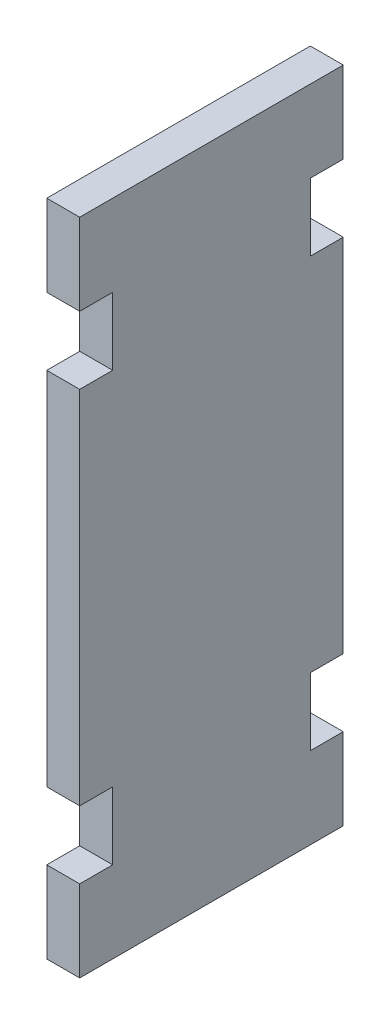
ISO-10303-21;
HEADER;
FILE_DESCRIPTION(('STEP AP214'),'2;1');
FILE_NAME('part.step','',(''),(''),'','','');
FILE_SCHEMA(('AUTOMOTIVE_DESIGN { 1 0 10303 214 1 1 1 1 }'));
ENDSEC;
DATA;
#1=APPLICATION_CONTEXT('core data for automotive mechanical design processes');
#2=APPLICATION_PROTOCOL_DEFINITION('international standard','automotive_design',2000,#1);
#3=PRODUCT_CONTEXT('',#1,'mechanical');
#4=PRODUCT('Part','Part','',(#3));
#5=PRODUCT_RELATED_PRODUCT_CATEGORY('part','',(#4));
#6=PRODUCT_DEFINITION_FORMATION('','',#4);
#7=PRODUCT_DEFINITION_CONTEXT('part definition',#1,'design');
#8=PRODUCT_DEFINITION('design','',#6,#7);
#9=PRODUCT_DEFINITION_SHAPE('','',#8);
#10=(LENGTH_UNIT() NAMED_UNIT(*) SI_UNIT(.MILLI.,.METRE.));
#11=(NAMED_UNIT(*) PLANE_ANGLE_UNIT() SI_UNIT($,.RADIAN.));
#12=(NAMED_UNIT(*) SI_UNIT($,.STERADIAN.) SOLID_ANGLE_UNIT());
#13=UNCERTAINTY_MEASURE_WITH_UNIT(LENGTH_MEASURE(1.E-05),#10,'distance_accuracy_value','');
#14=(GEOMETRIC_REPRESENTATION_CONTEXT(3) GLOBAL_UNCERTAINTY_ASSIGNED_CONTEXT((#13)) GLOBAL_UNIT_ASSIGNED_CONTEXT((#10,
#11,#12)) REPRESENTATION_CONTEXT('',''));
#15=CARTESIAN_POINT('',(0.,0.,0.));
#16=DIRECTION('',(0.,0.,1.));
#17=DIRECTION('',(1.,0.,0.));
#18=AXIS2_PLACEMENT_3D('',#15,#16,#17);
#19=CARTESIAN_POINT('',(4.99999999999999,-77.375,-15.));
#20=DIRECTION('',(0.,-1.,0.));
#21=DIRECTION('',(0.,0.,-0.999999999999997));
#22=AXIS2_PLACEMENT_3D('',#19,#20,#21);
#23=PLANE('',#22);
#24=DIRECTION('',(1.,0.,0.));
#25=VECTOR('',#24,1.);
#26=CARTESIAN_POINT('',(4.99999999999999,-77.375,-15.));
#27=LINE('',#26,#25);
#28=CARTESIAN_POINT('',(0.,-77.3750000000001,-14.9999999999997));
#29=VERTEX_POINT('',#28);
#30=CARTESIAN_POINT('',(4.99999999999999,-77.375,-15.));
#31=VERTEX_POINT('',#30);
#32=EDGE_CURVE('E11',#29,#31,#27,.T.);
#33=ORIENTED_EDGE('',*,*,#32,.F.);
#34=DIRECTION('',(0.,0.,-0.999999999999997));
#35=VECTOR('',#34,1.);
#36=CARTESIAN_POINT('',(0.,-77.3750000000001,19.9999999999999));
#37=LINE('',#36,#35);
#38=CARTESIAN_POINT('',(0.,-77.3750000000001,-19.9999999999997));
#39=VERTEX_POINT('',#38);
#40=EDGE_CURVE('E146',#29,#39,#37,.T.);
#41=ORIENTED_EDGE('',*,*,#40,.T.);
#42=DIRECTION('',(1.,0.,0.));
#43=VECTOR('',#42,1.);
#44=CARTESIAN_POINT('',(4.99999999999999,-77.375,-19.9999999999999));
#45=LINE('',#44,#43);
#46=CARTESIAN_POINT('',(4.99999999999999,-77.375,-19.9999999999999));
#47=VERTEX_POINT('',#46);
#48=EDGE_CURVE('E53',#39,#47,#45,.T.);
#49=ORIENTED_EDGE('',*,*,#48,.T.);
#50=DIRECTION('',(0.,0.,-0.999999999999997));
#51=VECTOR('',#50,1.);
#52=CARTESIAN_POINT('',(4.99999999999999,-77.375,-15.));
#53=LINE('',#52,#51);
#54=EDGE_CURVE('E279',#31,#47,#53,.T.);
#55=ORIENTED_EDGE('',*,*,#54,.F.);
#56=EDGE_LOOP('',(#33,#41,#49,#55));
#57=FACE_BOUND('',#56,.T.);
#58=ADVANCED_FACE('F43',(#57),#23,.T.);
#59=CARTESIAN_POINT('',(4.99999999999999,-100.,-19.9999999999999));
#60=DIRECTION('',(0.,0.,-1.));
#61=DIRECTION('',(0.,1.,0.));
#62=AXIS2_PLACEMENT_3D('',#59,#60,#61);
#63=PLANE('',#62);
#64=ORIENTED_EDGE('',*,*,#48,.F.);
#65=DIRECTION('',(0.,0.999999999999997,0.));
#66=VECTOR('',#65,1.);
#67=CARTESIAN_POINT('',(0.,-100.,-19.9999999999997));
#68=LINE('',#67,#66);
#69=CARTESIAN_POINT('',(0.,-22.6250000000005,-19.9999999999997));
#70=VERTEX_POINT('',#69);
#71=EDGE_CURVE('E221',#39,#70,#68,.T.);
#72=ORIENTED_EDGE('',*,*,#71,.T.);
#73=DIRECTION('',(1.,0.,0.));
#74=VECTOR('',#73,1.);
#75=CARTESIAN_POINT('',(4.99999999999999,-22.625,-19.9999999999999));
#76=LINE('',#75,#74);
#77=CARTESIAN_POINT('',(4.99999999999999,-22.625,-19.9999999999999));
#78=VERTEX_POINT('',#77);
#79=EDGE_CURVE('E272',#70,#78,#76,.T.);
#80=ORIENTED_EDGE('',*,*,#79,.T.);
#81=DIRECTION('',(0.,1.,0.));
#82=VECTOR('',#81,1.);
#83=CARTESIAN_POINT('',(4.99999999999999,-100.,-19.9999999999999));
#84=LINE('',#83,#82);
#85=EDGE_CURVE('E288',#47,#78,#84,.T.);
#86=ORIENTED_EDGE('',*,*,#85,.F.);
#87=EDGE_LOOP('',(#64,#72,#80,#86));
#88=FACE_BOUND('',#87,.T.);
#89=ADVANCED_FACE('F292',(#88),#63,.T.);
#90=CARTESIAN_POINT('',(4.99999999999999,-22.625,-15.));
#91=DIRECTION('',(0.,1.,0.));
#92=DIRECTION('',(0.,0.,0.999999999999997));
#93=AXIS2_PLACEMENT_3D('',#90,#91,#92);
#94=PLANE('',#93);
#95=ORIENTED_EDGE('',*,*,#79,.F.);
#96=DIRECTION('',(0.,0.,-0.999999999999997));
#97=VECTOR('',#96,1.);
#98=CARTESIAN_POINT('',(0.,-22.6250000000005,19.9999999999999));
#99=LINE('',#98,#97);
#100=CARTESIAN_POINT('',(0.,-22.6250000000005,-14.9999999999997));
#101=VERTEX_POINT('',#100);
#102=EDGE_CURVE('E217',#70,#101,#99,.F.);
#103=ORIENTED_EDGE('',*,*,#102,.T.);
#104=DIRECTION('',(1.,0.,0.));
#105=VECTOR('',#104,1.);
#106=CARTESIAN_POINT('',(4.99999999999999,-22.625,-15.));
#107=LINE('',#106,#105);
#108=CARTESIAN_POINT('',(4.99999999999999,-22.625,-15.));
#109=VERTEX_POINT('',#108);
#110=EDGE_CURVE('E269',#101,#109,#107,.T.);
#111=ORIENTED_EDGE('',*,*,#110,.T.);
#112=DIRECTION('',(0.,0.,0.999999999999997));
#113=VECTOR('',#112,1.);
#114=CARTESIAN_POINT('',(4.99999999999999,-22.625,-15.));
#115=LINE('',#114,#113);
#116=EDGE_CURVE('E294',#78,#109,#115,.T.);
#117=ORIENTED_EDGE('',*,*,#116,.F.);
#118=EDGE_LOOP('',(#95,#103,#111,#117));
#119=FACE_BOUND('',#118,.T.);
#120=ADVANCED_FACE('F451',(#119),#94,.T.);
#121=CARTESIAN_POINT('',(4.99999999999999,-22.625,-15.));
#122=DIRECTION('',(0.,0.,-1.));
#123=DIRECTION('',(0.,1.,0.));
#124=AXIS2_PLACEMENT_3D('',#121,#122,#123);
#125=PLANE('',#124);
#126=ORIENTED_EDGE('',*,*,#110,.F.);
#127=DIRECTION('',(0.,0.999999999999997,0.));
#128=VECTOR('',#127,1.);
#129=CARTESIAN_POINT('',(0.,-100.,-14.9999999999997));
#130=LINE('',#129,#128);
#131=CARTESIAN_POINT('',(0.,-12.3750000000006,-14.9999999999997));
#132=VERTEX_POINT('',#131);
#133=EDGE_CURVE('E213',#101,#132,#130,.T.);
#134=ORIENTED_EDGE('',*,*,#133,.T.);
#135=DIRECTION('',(1.,0.,0.));
#136=VECTOR('',#135,1.);
#137=CARTESIAN_POINT('',(4.99999999999999,-12.3750000000001,-15.));
#138=LINE('',#137,#136);
#139=CARTESIAN_POINT('',(4.99999999999999,-12.3750000000001,-15.));
#140=VERTEX_POINT('',#139);
#141=EDGE_CURVE('E266',#132,#140,#138,.T.);
#142=ORIENTED_EDGE('',*,*,#141,.T.);
#143=DIRECTION('',(0.,1.,0.));
#144=VECTOR('',#143,1.);
#145=CARTESIAN_POINT('',(4.99999999999999,-22.625,-15.));
#146=LINE('',#145,#144);
#147=EDGE_CURVE('E299',#109,#140,#146,.T.);
#148=ORIENTED_EDGE('',*,*,#147,.F.);
#149=EDGE_LOOP('',(#126,#134,#142,#148));
#150=FACE_BOUND('',#149,.T.);
#151=ADVANCED_FACE('F448',(#150),#125,.T.);
#152=CARTESIAN_POINT('',(4.99999999999999,-12.3750000000001,-15.));
#153=DIRECTION('',(0.,-1.,0.));
#154=DIRECTION('',(0.,0.,-0.999999999999997));
#155=AXIS2_PLACEMENT_3D('',#152,#153,#154);
#156=PLANE('',#155);
#157=ORIENTED_EDGE('',*,*,#141,.F.);
#158=DIRECTION('',(0.,0.,-0.999999999999997));
#159=VECTOR('',#158,1.);
#160=CARTESIAN_POINT('',(0.,-12.3750000000006,19.9999999999999));
#161=LINE('',#160,#159);
#162=CARTESIAN_POINT('',(0.,-12.3750000000006,-19.9999999999997));
#163=VERTEX_POINT('',#162);
#164=EDGE_CURVE('E209',#132,#163,#161,.T.);
#165=ORIENTED_EDGE('',*,*,#164,.T.);
#166=DIRECTION('',(1.,0.,0.));
#167=VECTOR('',#166,1.);
#168=CARTESIAN_POINT('',(4.99999999999999,-12.3750000000001,-19.9999999999999));
#169=LINE('',#168,#167);
#170=CARTESIAN_POINT('',(4.99999999999999,-12.3750000000001,-19.9999999999999));
#171=VERTEX_POINT('',#170);
#172=EDGE_CURVE('E263',#163,#171,#169,.T.);
#173=ORIENTED_EDGE('',*,*,#172,.T.);
#174=DIRECTION('',(0.,0.,-0.999999999999997));
#175=VECTOR('',#174,1.);
#176=CARTESIAN_POINT('',(4.99999999999999,-12.3750000000001,-15.));
#177=LINE('',#176,#175);
#178=EDGE_CURVE('E306',#140,#171,#177,.T.);
#179=ORIENTED_EDGE('',*,*,#178,.F.);
#180=EDGE_LOOP('',(#157,#165,#173,#179));
#181=FACE_BOUND('',#180,.T.);
#182=ADVANCED_FACE('F444',(#181),#156,.T.);
#183=ORIENTED_EDGE('',*,*,#172,.F.);
#184=DIRECTION('',(0.,0.999999999999997,0.));
#185=VECTOR('',#184,1.);
#186=CARTESIAN_POINT('',(0.,-100.,-19.9999999999997));
#187=LINE('',#186,#185);
#188=CARTESIAN_POINT('',(0.,-6.66133814775094E-13,-19.9999999999997));
#189=VERTEX_POINT('',#188);
#190=EDGE_CURVE('E205',#163,#189,#187,.T.);
#191=ORIENTED_EDGE('',*,*,#190,.T.);
#192=DIRECTION('',(1.,0.,0.));
#193=VECTOR('',#192,1.);
#194=CARTESIAN_POINT('',(4.99999999999999,0.,-19.9999999999999));
#195=LINE('',#194,#193);
#196=CARTESIAN_POINT('',(4.99999999999999,0.,-19.9999999999999));
#197=VERTEX_POINT('',#196);
#198=EDGE_CURVE('E260',#189,#197,#195,.T.);
#199=ORIENTED_EDGE('',*,*,#198,.T.);
#200=EDGE_CURVE('E296',#171,#197,#84,.T.);
#201=ORIENTED_EDGE('',*,*,#200,.F.);
#202=EDGE_LOOP('',(#183,#191,#199,#201));
#203=FACE_BOUND('',#202,.T.);
#204=ADVANCED_FACE('F442',(#203),#63,.T.);
#205=CARTESIAN_POINT('',(5.,0.,19.9999999999999));
#206=DIRECTION('',(0.,-1.,0.));
#207=DIRECTION('',(0.,0.,-0.999999999999997));
#208=AXIS2_PLACEMENT_3D('',#205,#206,#207);
#209=PLANE('',#208);
#210=ORIENTED_EDGE('',*,*,#198,.F.);
#211=DIRECTION('',(0.,0.,-0.999999999999997));
#212=VECTOR('',#211,1.);
#213=CARTESIAN_POINT('',(0.,-6.66133814775094E-13,19.9999999999999));
#214=LINE('',#213,#212);
#215=CARTESIAN_POINT('',(0.,-6.66133814775094E-13,19.9999999999999));
#216=VERTEX_POINT('',#215);
#217=EDGE_CURVE('E201',#216,#189,#214,.T.);
#218=ORIENTED_EDGE('',*,*,#217,.F.);
#219=DIRECTION('',(1.,0.,0.));
#220=VECTOR('',#219,1.);
#221=CARTESIAN_POINT('',(5.,0.,19.9999999999999));
#222=LINE('',#221,#220);
#223=CARTESIAN_POINT('',(5.,0.,19.9999999999999));
#224=VERTEX_POINT('',#223);
#225=EDGE_CURVE('E257',#216,#224,#222,.T.);
#226=ORIENTED_EDGE('',*,*,#225,.T.);
#227=DIRECTION('',(0.,0.,-0.999999999999997));
#228=VECTOR('',#227,1.);
#229=CARTESIAN_POINT('',(5.,0.,19.9999999999999));
#230=LINE('',#229,#228);
#231=EDGE_CURVE('E305',#224,#197,#230,.T.);
#232=ORIENTED_EDGE('',*,*,#231,.T.);
#233=EDGE_LOOP('',(#210,#218,#226,#232));
#234=FACE_BOUND('',#233,.T.);
#235=ADVANCED_FACE('F437',(#234),#209,.F.);
#236=CARTESIAN_POINT('',(5.,-100.,19.9999999999999));
#237=DIRECTION('',(0.,0.,-1.));
#238=DIRECTION('',(0.,1.,0.));
#239=AXIS2_PLACEMENT_3D('',#236,#237,#238);
#240=PLANE('',#239);
#241=ORIENTED_EDGE('',*,*,#225,.F.);
#242=DIRECTION('',(0.,0.999999999999997,0.));
#243=VECTOR('',#242,1.);
#244=CARTESIAN_POINT('',(0.,-100.,19.9999999999999));
#245=LINE('',#244,#243);
#246=CARTESIAN_POINT('',(0.,-12.3750000000006,19.9999999999999));
#247=VERTEX_POINT('',#246);
#248=EDGE_CURVE('E197',#247,#216,#245,.T.);
#249=ORIENTED_EDGE('',*,*,#248,.F.);
#250=DIRECTION('',(1.,0.,0.));
#251=VECTOR('',#250,1.);
#252=CARTESIAN_POINT('',(5.,-12.3750000000001,19.9999999999999));
#253=LINE('',#252,#251);
#254=CARTESIAN_POINT('',(5.,-12.3750000000001,19.9999999999999));
#255=VERTEX_POINT('',#254);
#256=EDGE_CURVE('E254',#247,#255,#253,.T.);
#257=ORIENTED_EDGE('',*,*,#256,.T.);
#258=DIRECTION('',(0.,1.,0.));
#259=VECTOR('',#258,1.);
#260=CARTESIAN_POINT('',(5.,-100.,19.9999999999999));
#261=LINE('',#260,#259);
#262=EDGE_CURVE('E315',#255,#224,#261,.T.);
#263=ORIENTED_EDGE('',*,*,#262,.T.);
#264=EDGE_LOOP('',(#241,#249,#257,#263));
#265=FACE_BOUND('',#264,.T.);
#266=ADVANCED_FACE('F435',(#265),#240,.F.);
#267=CARTESIAN_POINT('',(5.,-12.3750000000001,14.9999999999999));
#268=DIRECTION('',(0.,-1.,0.));
#269=DIRECTION('',(0.,0.,-0.999999999999997));
#270=AXIS2_PLACEMENT_3D('',#267,#268,#269);
#271=PLANE('',#270);
#272=ORIENTED_EDGE('',*,*,#256,.F.);
#273=DIRECTION('',(0.,0.,-0.999999999999997));
#274=VECTOR('',#273,1.);
#275=CARTESIAN_POINT('',(0.,-12.3750000000006,19.9999999999999));
#276=LINE('',#275,#274);
#277=CARTESIAN_POINT('',(0.,-12.3750000000006,15.));
#278=VERTEX_POINT('',#277);
#279=EDGE_CURVE('E193',#247,#278,#276,.T.);
#280=ORIENTED_EDGE('',*,*,#279,.T.);
#281=DIRECTION('',(1.,0.,0.));
#282=VECTOR('',#281,1.);
#283=CARTESIAN_POINT('',(5.,-12.3750000000001,14.9999999999999));
#284=LINE('',#283,#282);
#285=CARTESIAN_POINT('',(5.,-12.3750000000001,14.9999999999999));
#286=VERTEX_POINT('',#285);
#287=EDGE_CURVE('E251',#278,#286,#284,.T.);
#288=ORIENTED_EDGE('',*,*,#287,.T.);
#289=DIRECTION('',(0.,0.,-0.999999999999997));
#290=VECTOR('',#289,1.);
#291=CARTESIAN_POINT('',(5.,-12.3750000000001,14.9999999999999));
#292=LINE('',#291,#290);
#293=EDGE_CURVE('E328',#255,#286,#292,.T.);
#294=ORIENTED_EDGE('',*,*,#293,.F.);
#295=EDGE_LOOP('',(#272,#280,#288,#294));
#296=FACE_BOUND('',#295,.T.);
#297=ADVANCED_FACE('F433',(#296),#271,.T.);
#298=CARTESIAN_POINT('',(5.,-22.625,14.9999999999999));
#299=DIRECTION('',(0.,0.,1.));
#300=DIRECTION('',(0.,-1.,0.));
#301=AXIS2_PLACEMENT_3D('',#298,#299,#300);
#302=PLANE('',#301);
#303=ORIENTED_EDGE('',*,*,#287,.F.);
#304=DIRECTION('',(0.,0.999999999999997,0.));
#305=VECTOR('',#304,1.);
#306=CARTESIAN_POINT('',(0.,-100.,15.));
#307=LINE('',#306,#305);
#308=CARTESIAN_POINT('',(0.,-22.6250000000005,15.));
#309=VERTEX_POINT('',#308);
#310=EDGE_CURVE('E189',#278,#309,#307,.F.);
#311=ORIENTED_EDGE('',*,*,#310,.T.);
#312=DIRECTION('',(1.,0.,0.));
#313=VECTOR('',#312,1.);
#314=CARTESIAN_POINT('',(5.,-22.625,14.9999999999999));
#315=LINE('',#314,#313);
#316=CARTESIAN_POINT('',(5.,-22.625,14.9999999999999));
#317=VERTEX_POINT('',#316);
#318=EDGE_CURVE('E248',#309,#317,#315,.T.);
#319=ORIENTED_EDGE('',*,*,#318,.T.);
#320=DIRECTION('',(0.,-1.,0.));
#321=VECTOR('',#320,1.);
#322=CARTESIAN_POINT('',(5.,-22.625,14.9999999999999));
#323=LINE('',#322,#321);
#324=EDGE_CURVE('E334',#286,#317,#323,.T.);
#325=ORIENTED_EDGE('',*,*,#324,.F.);
#326=EDGE_LOOP('',(#303,#311,#319,#325));
#327=FACE_BOUND('',#326,.T.);
#328=ADVANCED_FACE('F423',(#327),#302,.T.);
#329=CARTESIAN_POINT('',(5.,-22.625,14.9999999999999));
#330=DIRECTION('',(0.,1.,0.));
#331=DIRECTION('',(0.,0.,0.999999999999997));
#332=AXIS2_PLACEMENT_3D('',#329,#330,#331);
#333=PLANE('',#332);
#334=ORIENTED_EDGE('',*,*,#318,.F.);
#335=DIRECTION('',(0.,0.,-0.999999999999997));
#336=VECTOR('',#335,1.);
#337=CARTESIAN_POINT('',(0.,-22.6250000000005,19.9999999999999));
#338=LINE('',#337,#336);
#339=CARTESIAN_POINT('',(0.,-22.6250000000005,19.9999999999999));
#340=VERTEX_POINT('',#339);
#341=EDGE_CURVE('E185',#309,#340,#338,.F.);
#342=ORIENTED_EDGE('',*,*,#341,.T.);
#343=DIRECTION('',(1.,0.,0.));
#344=VECTOR('',#343,1.);
#345=CARTESIAN_POINT('',(5.,-22.625,19.9999999999999));
#346=LINE('',#345,#344);
#347=CARTESIAN_POINT('',(5.,-22.625,19.9999999999999));
#348=VERTEX_POINT('',#347);
#349=EDGE_CURVE('E245',#340,#348,#346,.T.);
#350=ORIENTED_EDGE('',*,*,#349,.T.);
#351=DIRECTION('',(0.,0.,0.999999999999997));
#352=VECTOR('',#351,1.);
#353=CARTESIAN_POINT('',(5.,-22.625,14.9999999999999));
#354=LINE('',#353,#352);
#355=EDGE_CURVE('E338',#317,#348,#354,.T.);
#356=ORIENTED_EDGE('',*,*,#355,.F.);
#357=EDGE_LOOP('',(#334,#342,#350,#356));
#358=FACE_BOUND('',#357,.T.);
#359=ADVANCED_FACE('F429',(#358),#333,.T.);
#360=ORIENTED_EDGE('',*,*,#349,.F.);
#361=DIRECTION('',(0.,0.999999999999997,0.));
#362=VECTOR('',#361,1.);
#363=CARTESIAN_POINT('',(0.,-100.,19.9999999999999));
#364=LINE('',#363,#362);
#365=CARTESIAN_POINT('',(0.,-77.3750000000001,19.9999999999999));
#366=VERTEX_POINT('',#365);
#367=EDGE_CURVE('E181',#366,#340,#364,.T.);
#368=ORIENTED_EDGE('',*,*,#367,.F.);
#369=DIRECTION('',(1.,0.,0.));
#370=VECTOR('',#369,1.);
#371=CARTESIAN_POINT('',(4.99999999999999,-77.375,19.9999999999999));
#372=LINE('',#371,#370);
#373=CARTESIAN_POINT('',(4.99999999999999,-77.375,19.9999999999999));
#374=VERTEX_POINT('',#373);
#375=EDGE_CURVE('E242',#366,#374,#372,.T.);
#376=ORIENTED_EDGE('',*,*,#375,.T.);
#377=EDGE_CURVE('E330',#374,#348,#261,.T.);
#378=ORIENTED_EDGE('',*,*,#377,.T.);
#379=EDGE_LOOP('',(#360,#368,#376,#378));
#380=FACE_BOUND('',#379,.T.);
#381=ADVANCED_FACE('F368',(#380),#240,.F.);
#382=CARTESIAN_POINT('',(4.99999999999999,-77.375,14.9999999999999));
#383=DIRECTION('',(0.,-1.,0.));
#384=DIRECTION('',(0.,0.,-0.999999999999997));
#385=AXIS2_PLACEMENT_3D('',#382,#383,#384);
#386=PLANE('',#385);
#387=ORIENTED_EDGE('',*,*,#375,.F.);
#388=DIRECTION('',(0.,0.,-0.999999999999997));
#389=VECTOR('',#388,1.);
#390=CARTESIAN_POINT('',(0.,-77.3750000000001,19.9999999999999));
#391=LINE('',#390,#389);
#392=CARTESIAN_POINT('',(0.,-77.3750000000001,15.));
#393=VERTEX_POINT('',#392);
#394=EDGE_CURVE('E177',#366,#393,#391,.T.);
#395=ORIENTED_EDGE('',*,*,#394,.T.);
#396=DIRECTION('',(1.,0.,0.));
#397=VECTOR('',#396,1.);
#398=CARTESIAN_POINT('',(4.99999999999999,-77.375,14.9999999999999));
#399=LINE('',#398,#397);
#400=CARTESIAN_POINT('',(4.99999999999999,-77.375,14.9999999999999));
#401=VERTEX_POINT('',#400);
#402=EDGE_CURVE('E239',#393,#401,#399,.T.);
#403=ORIENTED_EDGE('',*,*,#402,.T.);
#404=DIRECTION('',(0.,0.,-0.999999999999997));
#405=VECTOR('',#404,1.);
#406=CARTESIAN_POINT('',(4.99999999999999,-77.375,14.9999999999999));
#407=LINE('',#406,#405);
#408=EDGE_CURVE('E342',#374,#401,#407,.T.);
#409=ORIENTED_EDGE('',*,*,#408,.F.);
#410=EDGE_LOOP('',(#387,#395,#403,#409));
#411=FACE_BOUND('',#410,.T.);
#412=ADVANCED_FACE('F379',(#411),#386,.T.);
#413=CARTESIAN_POINT('',(4.99999999999999,-77.375,14.9999999999999));
#414=DIRECTION('',(0.,0.,1.));
#415=DIRECTION('',(0.,-1.,0.));
#416=AXIS2_PLACEMENT_3D('',#413,#414,#415);
#417=PLANE('',#416);
#418=ORIENTED_EDGE('',*,*,#402,.F.);
#419=DIRECTION('',(0.,0.999999999999997,0.));
#420=VECTOR('',#419,1.);
#421=CARTESIAN_POINT('',(0.,-100.,15.));
#422=LINE('',#421,#420);
#423=CARTESIAN_POINT('',(0.,-87.6250000000001,15.));
#424=VERTEX_POINT('',#423);
#425=EDGE_CURVE('E173',#393,#424,#422,.F.);
#426=ORIENTED_EDGE('',*,*,#425,.T.);
#427=DIRECTION('',(1.,0.,0.));
#428=VECTOR('',#427,1.);
#429=CARTESIAN_POINT('',(4.99999999999999,-87.625,14.9999999999999));
#430=LINE('',#429,#428);
#431=CARTESIAN_POINT('',(4.99999999999999,-87.625,14.9999999999999));
#432=VERTEX_POINT('',#431);
#433=EDGE_CURVE('E236',#424,#432,#430,.T.);
#434=ORIENTED_EDGE('',*,*,#433,.T.);
#435=DIRECTION('',(0.,-1.,0.));
#436=VECTOR('',#435,1.);
#437=CARTESIAN_POINT('',(4.99999999999999,-77.375,14.9999999999999));
#438=LINE('',#437,#436);
#439=EDGE_CURVE('E346',#401,#432,#438,.T.);
#440=ORIENTED_EDGE('',*,*,#439,.F.);
#441=EDGE_LOOP('',(#418,#426,#434,#440));
#442=FACE_BOUND('',#441,.T.);
#443=ADVANCED_FACE('F385',(#442),#417,.T.);
#444=CARTESIAN_POINT('',(4.99999999999999,-87.625,14.9999999999999));
#445=DIRECTION('',(0.,1.,0.));
#446=DIRECTION('',(0.,0.,0.999999999999997));
#447=AXIS2_PLACEMENT_3D('',#444,#445,#446);
#448=PLANE('',#447);
#449=ORIENTED_EDGE('',*,*,#433,.F.);
#450=DIRECTION('',(0.,0.,-0.999999999999997));
#451=VECTOR('',#450,1.);
#452=CARTESIAN_POINT('',(0.,-87.6250000000001,19.9999999999999));
#453=LINE('',#452,#451);
#454=CARTESIAN_POINT('',(0.,-87.6250000000001,19.9999999999999));
#455=VERTEX_POINT('',#454);
#456=EDGE_CURVE('E169',#424,#455,#453,.F.);
#457=ORIENTED_EDGE('',*,*,#456,.T.);
#458=DIRECTION('',(1.,0.,0.));
#459=VECTOR('',#458,1.);
#460=CARTESIAN_POINT('',(4.99999999999999,-87.625,19.9999999999999));
#461=LINE('',#460,#459);
#462=CARTESIAN_POINT('',(4.99999999999999,-87.625,19.9999999999999));
#463=VERTEX_POINT('',#462);
#464=EDGE_CURVE('E233',#455,#463,#461,.T.);
#465=ORIENTED_EDGE('',*,*,#464,.T.);
#466=DIRECTION('',(0.,0.,0.999999999999997));
#467=VECTOR('',#466,1.);
#468=CARTESIAN_POINT('',(4.99999999999999,-87.625,14.9999999999999));
#469=LINE('',#468,#467);
#470=EDGE_CURVE('E349',#432,#463,#469,.T.);
#471=ORIENTED_EDGE('',*,*,#470,.F.);
#472=EDGE_LOOP('',(#449,#457,#465,#471));
#473=FACE_BOUND('',#472,.T.);
#474=ADVANCED_FACE('F390',(#473),#448,.T.);
#475=ORIENTED_EDGE('',*,*,#464,.F.);
#476=DIRECTION('',(0.,0.999999999999997,0.));
#477=VECTOR('',#476,1.);
#478=CARTESIAN_POINT('',(0.,-100.,19.9999999999999));
#479=LINE('',#478,#477);
#480=CARTESIAN_POINT('',(0.,-100.,19.9999999999999));
#481=VERTEX_POINT('',#480);
#482=EDGE_CURVE('E165',#481,#455,#479,.T.);
#483=ORIENTED_EDGE('',*,*,#482,.F.);
#484=DIRECTION('',(1.,0.,0.));
#485=VECTOR('',#484,1.);
#486=CARTESIAN_POINT('',(5.,-100.,19.9999999999999));
#487=LINE('',#486,#485);
#488=CARTESIAN_POINT('',(5.,-100.,19.9999999999999));
#489=VERTEX_POINT('',#488);
#490=EDGE_CURVE('E230',#481,#489,#487,.T.);
#491=ORIENTED_EDGE('',*,*,#490,.T.);
#492=EDGE_CURVE('E329',#489,#463,#261,.T.);
#493=ORIENTED_EDGE('',*,*,#492,.T.);
#494=EDGE_LOOP('',(#475,#483,#491,#493));
#495=FACE_BOUND('',#494,.T.);
#496=ADVANCED_FACE('F393',(#495),#240,.F.);
#497=CARTESIAN_POINT('',(5.,-100.,19.9999999999999));
#498=DIRECTION('',(0.,-1.,0.));
#499=DIRECTION('',(0.,0.,-0.999999999999997));
#500=AXIS2_PLACEMENT_3D('',#497,#498,#499);
#501=PLANE('',#500);
#502=ORIENTED_EDGE('',*,*,#490,.F.);
#503=DIRECTION('',(0.,0.,-0.999999999999997));
#504=VECTOR('',#503,1.);
#505=CARTESIAN_POINT('',(0.,-100.,19.9999999999999));
#506=LINE('',#505,#504);
#507=CARTESIAN_POINT('',(0.,-100.,-19.9999999999997));
#508=VERTEX_POINT('',#507);
#509=EDGE_CURVE('E161',#481,#508,#506,.T.);
#510=ORIENTED_EDGE('',*,*,#509,.T.);
#511=DIRECTION('',(1.,0.,0.));
#512=VECTOR('',#511,1.);
#513=CARTESIAN_POINT('',(4.99999999999999,-100.,-19.9999999999999));
#514=LINE('',#513,#512);
#515=CARTESIAN_POINT('',(4.99999999999999,-100.,-19.9999999999999));
#516=VERTEX_POINT('',#515);
#517=EDGE_CURVE('E228',#508,#516,#514,.T.);
#518=ORIENTED_EDGE('',*,*,#517,.T.);
#519=DIRECTION('',(0.,0.,-0.999999999999997));
#520=VECTOR('',#519,1.);
#521=CARTESIAN_POINT('',(5.,-100.,19.9999999999999));
#522=LINE('',#521,#520);
#523=EDGE_CURVE('E155',#489,#516,#522,.T.);
#524=ORIENTED_EDGE('',*,*,#523,.F.);
#525=EDGE_LOOP('',(#502,#510,#518,#524));
#526=FACE_BOUND('',#525,.T.);
#527=ADVANCED_FACE('F396',(#526),#501,.T.);
#528=ORIENTED_EDGE('',*,*,#517,.F.);
#529=DIRECTION('',(0.,0.999999999999997,0.));
#530=VECTOR('',#529,1.);
#531=CARTESIAN_POINT('',(0.,-100.,-19.9999999999997));
#532=LINE('',#531,#530);
#533=CARTESIAN_POINT('',(0.,-87.6250000000001,-19.9999999999997));
#534=VERTEX_POINT('',#533);
#535=EDGE_CURVE('E157',#508,#534,#532,.T.);
#536=ORIENTED_EDGE('',*,*,#535,.T.);
#537=DIRECTION('',(1.,0.,0.));
#538=VECTOR('',#537,1.);
#539=CARTESIAN_POINT('',(4.99999999999999,-87.625,-19.9999999999999));
#540=LINE('',#539,#538);
#541=CARTESIAN_POINT('',(4.99999999999999,-87.625,-19.9999999999999));
#542=VERTEX_POINT('',#541);
#543=EDGE_CURVE('E61',#534,#542,#540,.T.);
#544=ORIENTED_EDGE('',*,*,#543,.T.);
#545=EDGE_CURVE('E139',#516,#542,#84,.T.);
#546=ORIENTED_EDGE('',*,*,#545,.F.);
#547=EDGE_LOOP('',(#528,#536,#544,#546));
#548=FACE_BOUND('',#547,.T.);
#549=ADVANCED_FACE('F397',(#548),#63,.T.);
#550=CARTESIAN_POINT('',(4.99999999999999,-87.625,-15.));
#551=DIRECTION('',(0.,1.,0.));
#552=DIRECTION('',(0.,0.,0.999999999999997));
#553=AXIS2_PLACEMENT_3D('',#550,#551,#552);
#554=PLANE('',#553);
#555=ORIENTED_EDGE('',*,*,#543,.F.);
#556=DIRECTION('',(0.,0.,-0.999999999999997));
#557=VECTOR('',#556,1.);
#558=CARTESIAN_POINT('',(0.,-87.6250000000001,19.9999999999999));
#559=LINE('',#558,#557);
#560=CARTESIAN_POINT('',(0.,-87.6250000000001,-14.9999999999997));
#561=VERTEX_POINT('',#560);
#562=EDGE_CURVE('E144',#534,#561,#559,.F.);
#563=ORIENTED_EDGE('',*,*,#562,.T.);
#564=DIRECTION('',(1.,0.,0.));
#565=VECTOR('',#564,1.);
#566=CARTESIAN_POINT('',(4.99999999999999,-87.625,-15.));
#567=LINE('',#566,#565);
#568=CARTESIAN_POINT('',(4.99999999999999,-87.625,-15.));
#569=VERTEX_POINT('',#568);
#570=EDGE_CURVE('E47',#561,#569,#567,.T.);
#571=ORIENTED_EDGE('',*,*,#570,.T.);
#572=DIRECTION('',(0.,0.,0.999999999999997));
#573=VECTOR('',#572,1.);
#574=CARTESIAN_POINT('',(4.99999999999999,-87.625,-15.));
#575=LINE('',#574,#573);
#576=EDGE_CURVE('E160',#542,#569,#575,.T.);
#577=ORIENTED_EDGE('',*,*,#576,.F.);
#578=EDGE_LOOP('',(#555,#563,#571,#577));
#579=FACE_BOUND('',#578,.T.);
#580=ADVANCED_FACE('F149',(#579),#554,.T.);
#581=CARTESIAN_POINT('',(4.99999999999999,-77.375,-15.));
#582=DIRECTION('',(0.,0.,-1.));
#583=DIRECTION('',(0.,1.,0.));
#584=AXIS2_PLACEMENT_3D('',#581,#582,#583);
#585=PLANE('',#584);
#586=DIRECTION('',(0.,0.999999999999997,0.));
#587=VECTOR('',#586,1.);
#588=CARTESIAN_POINT('',(0.,-100.,-14.9999999999997));
#589=LINE('',#588,#587);
#590=EDGE_CURVE('E133',#561,#29,#589,.T.);
#591=ORIENTED_EDGE('',*,*,#590,.T.);
#592=ORIENTED_EDGE('',*,*,#32,.T.);
#593=DIRECTION('',(0.,1.,0.));
#594=VECTOR('',#593,1.);
#595=CARTESIAN_POINT('',(4.99999999999999,-77.375,-15.));
#596=LINE('',#595,#594);
#597=EDGE_CURVE('E135',#569,#31,#596,.T.);
#598=ORIENTED_EDGE('',*,*,#597,.F.);
#599=ORIENTED_EDGE('',*,*,#570,.F.);
#600=EDGE_LOOP('',(#591,#592,#598,#599));
#601=FACE_BOUND('',#600,.T.);
#602=ADVANCED_FACE('F45',(#601),#585,.T.);
#603=CARTESIAN_POINT('',(5.,-100.,19.9999999999999));
#604=DIRECTION('',(1.,0.,0.));
#605=DIRECTION('',(0.,0.,-0.999999999999997));
#606=AXIS2_PLACEMENT_3D('',#603,#604,#605);
#607=PLANE('',#606);
#608=ORIENTED_EDGE('',*,*,#576,.T.);
#609=ORIENTED_EDGE('',*,*,#597,.T.);
#610=ORIENTED_EDGE('',*,*,#54,.T.);
#611=ORIENTED_EDGE('',*,*,#85,.T.);
#612=ORIENTED_EDGE('',*,*,#116,.T.);
#613=ORIENTED_EDGE('',*,*,#147,.T.);
#614=ORIENTED_EDGE('',*,*,#178,.T.);
#615=ORIENTED_EDGE('',*,*,#200,.T.);
#616=ORIENTED_EDGE('',*,*,#231,.F.);
#617=ORIENTED_EDGE('',*,*,#262,.F.);
#618=ORIENTED_EDGE('',*,*,#293,.T.);
#619=ORIENTED_EDGE('',*,*,#324,.T.);
#620=ORIENTED_EDGE('',*,*,#355,.T.);
#621=ORIENTED_EDGE('',*,*,#377,.F.);
#622=ORIENTED_EDGE('',*,*,#408,.T.);
#623=ORIENTED_EDGE('',*,*,#439,.T.);
#624=ORIENTED_EDGE('',*,*,#470,.T.);
#625=ORIENTED_EDGE('',*,*,#492,.F.);
#626=ORIENTED_EDGE('',*,*,#523,.T.);
#627=ORIENTED_EDGE('',*,*,#545,.T.);
#628=EDGE_LOOP('',(#608,#609,#610,#611,#612,#613,#614,#615,#616,#617,#618,#619,#620,#621,#622,
#623,#624,#625,#626,#627));
#629=FACE_BOUND('',#628,.T.);
#630=ADVANCED_FACE('F286',(#629),#607,.T.);
#631=CARTESIAN_POINT('',(0.,-100.,19.9999999999999));
#632=DIRECTION('',(1.,0.,0.));
#633=DIRECTION('',(0.,0.,-0.999999999999997));
#634=AXIS2_PLACEMENT_3D('',#631,#632,#633);
#635=PLANE('',#634);
#636=ORIENTED_EDGE('',*,*,#562,.F.);
#637=ORIENTED_EDGE('',*,*,#535,.F.);
#638=ORIENTED_EDGE('',*,*,#509,.F.);
#639=ORIENTED_EDGE('',*,*,#482,.T.);
#640=ORIENTED_EDGE('',*,*,#456,.F.);
#641=ORIENTED_EDGE('',*,*,#425,.F.);
#642=ORIENTED_EDGE('',*,*,#394,.F.);
#643=ORIENTED_EDGE('',*,*,#367,.T.);
#644=ORIENTED_EDGE('',*,*,#341,.F.);
#645=ORIENTED_EDGE('',*,*,#310,.F.);
#646=ORIENTED_EDGE('',*,*,#279,.F.);
#647=ORIENTED_EDGE('',*,*,#248,.T.);
#648=ORIENTED_EDGE('',*,*,#217,.T.);
#649=ORIENTED_EDGE('',*,*,#190,.F.);
#650=ORIENTED_EDGE('',*,*,#164,.F.);
#651=ORIENTED_EDGE('',*,*,#133,.F.);
#652=ORIENTED_EDGE('',*,*,#102,.F.);
#653=ORIENTED_EDGE('',*,*,#71,.F.);
#654=ORIENTED_EDGE('',*,*,#40,.F.);
#655=ORIENTED_EDGE('',*,*,#590,.F.);
#656=EDGE_LOOP('',(#636,#637,#638,#639,#640,#641,#642,#643,#644,#645,#646,#647,#648,#649,#650,
#651,#652,#653,#654,#655));
#657=FACE_BOUND('',#656,.T.);
#658=ADVANCED_FACE('F142',(#657),#635,.F.);
#659=CLOSED_SHELL('',(#58,#89,#120,#151,#182,#204,#235,#266,#297,#328,#359,#381,#412,#443,#474,
#496,#527,#549,#580,#602,#630,#658));
#660=MANIFOLD_SOLID_BREP('B2',#659);
#661=ADVANCED_BREP_SHAPE_REPRESENTATION('',(#18,#660),#14);
#662=SHAPE_DEFINITION_REPRESENTATION(#9,#661);
ENDSEC;
END-ISO-10303-21;
